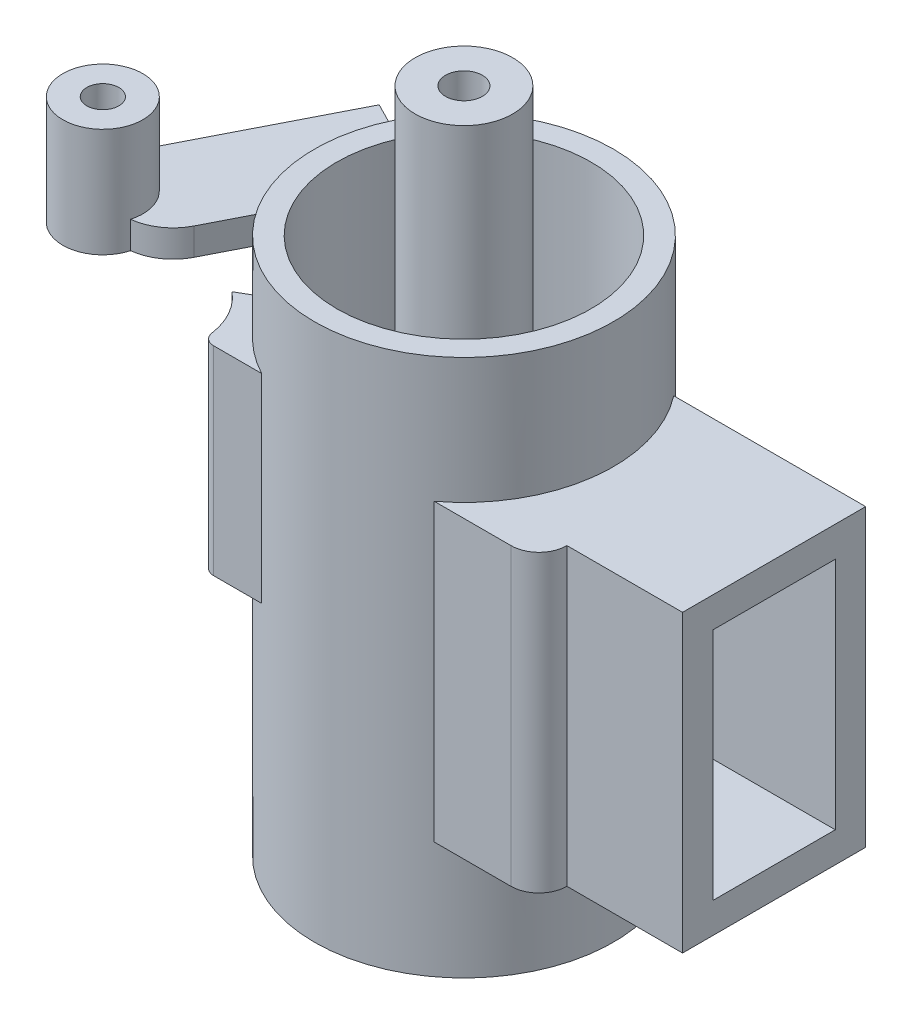
ISO-10303-21;
HEADER;
FILE_DESCRIPTION(('STEP AP214'),'2;1');
FILE_NAME('part.step','',(''),(''),'','','');
FILE_SCHEMA(('AUTOMOTIVE_DESIGN { 1 0 10303 214 1 1 1 1 }'));
ENDSEC;
DATA;
#1=APPLICATION_CONTEXT('core data for automotive mechanical design processes');
#2=APPLICATION_PROTOCOL_DEFINITION('international standard','automotive_design',2000,#1);
#3=PRODUCT_CONTEXT('',#1,'mechanical');
#4=PRODUCT('Part','Part','',(#3));
#5=PRODUCT_RELATED_PRODUCT_CATEGORY('part','',(#4));
#6=PRODUCT_DEFINITION_FORMATION('','',#4);
#7=PRODUCT_DEFINITION_CONTEXT('part definition',#1,'design');
#8=PRODUCT_DEFINITION('design','',#6,#7);
#9=PRODUCT_DEFINITION_SHAPE('','',#8);
#10=(LENGTH_UNIT() NAMED_UNIT(*) SI_UNIT(.MILLI.,.METRE.));
#11=(NAMED_UNIT(*) PLANE_ANGLE_UNIT() SI_UNIT($,.RADIAN.));
#12=(NAMED_UNIT(*) SI_UNIT($,.STERADIAN.) SOLID_ANGLE_UNIT());
#13=UNCERTAINTY_MEASURE_WITH_UNIT(LENGTH_MEASURE(1.E-05),#10,'distance_accuracy_value','');
#14=(GEOMETRIC_REPRESENTATION_CONTEXT(3) GLOBAL_UNCERTAINTY_ASSIGNED_CONTEXT((#13)) GLOBAL_UNIT_ASSIGNED_CONTEXT((#10,
#11,#12)) REPRESENTATION_CONTEXT('',''));
#15=CARTESIAN_POINT('',(0.,0.,0.));
#16=DIRECTION('',(0.,0.,1.));
#17=DIRECTION('',(1.,0.,0.));
#18=AXIS2_PLACEMENT_3D('',#15,#16,#17);
#19=CARTESIAN_POINT('',(0.,31.6,0.));
#20=DIRECTION('',(0.,-1.,0.));
#21=DIRECTION('',(0.,0.,-1.));
#22=AXIS2_PLACEMENT_3D('',#19,#20,#21);
#23=CYLINDRICAL_SURFACE('',#22,9.35);
#24=CARTESIAN_POINT('',(0.,33.6,0.));
#25=DIRECTION('',(0.,1.,0.));
#26=DIRECTION('',(0.,0.,1.));
#27=AXIS2_PLACEMENT_3D('',#24,#25,#26);
#28=CIRCLE('',#27,9.35);
#29=CARTESIAN_POINT('',(0.,33.6,9.35));
#30=VERTEX_POINT('',#29);
#31=EDGE_CURVE('E283',#30,#30,#28,.T.);
#32=ORIENTED_EDGE('',*,*,#31,.F.);
#33=EDGE_LOOP('',(#32));
#34=FACE_BOUND('',#33,.T.);
#35=DIRECTION('',(0.,-1.,0.));
#36=VECTOR('',#35,1.);
#37=CARTESIAN_POINT('',(-4.39999999999999,28.05,8.25));
#38=LINE('',#37,#36);
#39=CARTESIAN_POINT('',(-4.4,28.05,8.25));
#40=VERTEX_POINT('',#39);
#41=CARTESIAN_POINT('',(-4.39999999999999,15.6,8.25));
#42=VERTEX_POINT('',#41);
#43=EDGE_CURVE('E313',#40,#42,#38,.T.);
#44=ORIENTED_EDGE('',*,*,#43,.T.);
#45=CARTESIAN_POINT('',(0.,15.6,0.));
#46=DIRECTION('',(0.,1.,0.));
#47=DIRECTION('',(0.,0.,-1.));
#48=AXIS2_PLACEMENT_3D('',#45,#46,#47);
#49=CIRCLE('',#48,9.35);
#50=CARTESIAN_POINT('',(-8.45118334909378,15.6,4.));
#51=VERTEX_POINT('',#50);
#52=EDGE_CURVE('E286',#51,#42,#49,.T.);
#53=ORIENTED_EDGE('',*,*,#52,.F.);
#54=DIRECTION('',(0.,-1.,0.));
#55=VECTOR('',#54,1.);
#56=CARTESIAN_POINT('',(-8.45118334909378,28.05,4.));
#57=LINE('',#56,#55);
#58=CARTESIAN_POINT('',(-8.45118334909378,28.05,4.));
#59=VERTEX_POINT('',#58);
#60=EDGE_CURVE('E78',#59,#51,#57,.T.);
#61=ORIENTED_EDGE('',*,*,#60,.F.);
#62=CARTESIAN_POINT('',(0.,28.05,0.));
#63=DIRECTION('',(0.,-1.,0.));
#64=DIRECTION('',(0.,0.,1.));
#65=AXIS2_PLACEMENT_3D('',#62,#63,#64);
#66=CIRCLE('',#65,9.35);
#67=EDGE_CURVE('E301',#40,#59,#66,.T.);
#68=ORIENTED_EDGE('',*,*,#67,.F.);
#69=EDGE_LOOP('',(#44,#53,#61,#68));
#70=FACE_BOUND('',#69,.T.);
#71=DIRECTION('',(0.,-1.,0.));
#72=VECTOR('',#71,1.);
#73=CARTESIAN_POINT('',(5.61666048466524,25.75,7.475));
#74=LINE('',#73,#72);
#75=CARTESIAN_POINT('',(5.61666048466525,25.75,7.475));
#76=VERTEX_POINT('',#75);
#77=CARTESIAN_POINT('',(5.61666048466524,7.3,7.475));
#78=VERTEX_POINT('',#77);
#79=EDGE_CURVE('E428',#76,#78,#74,.T.);
#80=ORIENTED_EDGE('',*,*,#79,.F.);
#81=CARTESIAN_POINT('',(0.,25.75,0.));
#82=DIRECTION('',(0.,1.,0.));
#83=DIRECTION('',(0.,0.,1.));
#84=AXIS2_PLACEMENT_3D('',#81,#82,#83);
#85=CIRCLE('',#84,9.35);
#86=CARTESIAN_POINT('',(7.39235246724613,25.75,-5.725));
#87=VERTEX_POINT('',#86);
#88=EDGE_CURVE('E385',#76,#87,#85,.T.);
#89=ORIENTED_EDGE('',*,*,#88,.T.);
#90=DIRECTION('',(0.,-1.,0.));
#91=VECTOR('',#90,1.);
#92=CARTESIAN_POINT('',(7.39235246724613,25.75,-5.725));
#93=LINE('',#92,#91);
#94=CARTESIAN_POINT('',(7.39235246724613,7.3,-5.725));
#95=VERTEX_POINT('',#94);
#96=EDGE_CURVE('E402',#87,#95,#93,.T.);
#97=ORIENTED_EDGE('',*,*,#96,.T.);
#98=CARTESIAN_POINT('',(0.,7.3,0.));
#99=DIRECTION('',(0.,1.,0.));
#100=DIRECTION('',(0.,0.,1.));
#101=AXIS2_PLACEMENT_3D('',#98,#99,#100);
#102=CIRCLE('',#101,9.35);
#103=EDGE_CURVE('E384',#78,#95,#102,.T.);
#104=ORIENTED_EDGE('',*,*,#103,.F.);
#105=EDGE_LOOP('',(#80,#89,#97,#104));
#106=FACE_BOUND('',#105,.T.);
#107=CARTESIAN_POINT('',(0.,0.,0.));
#108=DIRECTION('',(0.,1.,0.));
#109=DIRECTION('',(0.,0.,1.));
#110=AXIS2_PLACEMENT_3D('',#107,#108,#109);
#111=CIRCLE('',#110,9.35);
#112=CARTESIAN_POINT('',(0.,0.,9.35));
#113=VERTEX_POINT('',#112);
#114=EDGE_CURVE('E434',#113,#113,#111,.T.);
#115=ORIENTED_EDGE('',*,*,#114,.T.);
#116=EDGE_LOOP('',(#115));
#117=FACE_BOUND('',#116,.T.);
#118=CARTESIAN_POINT('',(0.,32.5,0.));
#119=DIRECTION('',(0.,-1.,0.));
#120=DIRECTION('',(0.,0.,1.));
#121=AXIS2_PLACEMENT_3D('',#118,#119,#120);
#122=CIRCLE('',#121,9.35);
#123=CARTESIAN_POINT('',(-8.52611136715884,32.5,3.83769787174613));
#124=VERTEX_POINT('',#123);
#125=CARTESIAN_POINT('',(-8.3282651254628,32.5,-4.25));
#126=VERTEX_POINT('',#125);
#127=EDGE_CURVE('E249',#124,#126,#122,.T.);
#128=ORIENTED_EDGE('',*,*,#127,.F.);
#129=DIRECTION('',(0.,1.,0.));
#130=VECTOR('',#129,1.);
#131=CARTESIAN_POINT('',(-8.52611136715884,29.9,3.83769787174613));
#132=LINE('',#131,#130);
#133=CARTESIAN_POINT('',(-8.52611136715884,30.8,3.83769787174613));
#134=VERTEX_POINT('',#133);
#135=EDGE_CURVE('E12',#134,#124,#132,.T.);
#136=ORIENTED_EDGE('',*,*,#135,.F.);
#137=CARTESIAN_POINT('',(0.,30.8,0.));
#138=DIRECTION('',(0.,1.,0.));
#139=DIRECTION('',(0.,0.,-1.));
#140=AXIS2_PLACEMENT_3D('',#137,#138,#139);
#141=CIRCLE('',#140,9.35);
#142=CARTESIAN_POINT('',(-8.3282651254628,30.8,-4.25));
#143=VERTEX_POINT('',#142);
#144=EDGE_CURVE('E276',#143,#134,#141,.T.);
#145=ORIENTED_EDGE('',*,*,#144,.F.);
#146=DIRECTION('',(0.,1.,0.));
#147=VECTOR('',#146,1.);
#148=CARTESIAN_POINT('',(-8.3282651254628,29.9,-4.25));
#149=LINE('',#148,#147);
#150=EDGE_CURVE('E59',#143,#126,#149,.T.);
#151=ORIENTED_EDGE('',*,*,#150,.T.);
#152=EDGE_LOOP('',(#128,#136,#145,#151));
#153=FACE_BOUND('',#152,.T.);
#154=ADVANCED_FACE('F55',(#34,#70,#106,#117,#153),#23,.T.);
#155=CARTESIAN_POINT('',(-10.0539859758351,29.9,6.83170841751514));
#156=DIRECTION('',(0.890723542830247,0.,0.454545454545455));
#157=DIRECTION('',(0.454545454545455,0.,-0.890723542830247));
#158=AXIS2_PLACEMENT_3D('',#155,#156,#157);
#159=PLANE('',#158);
#160=DIRECTION('',(0.,1.,0.));
#161=VECTOR('',#160,1.);
#162=CARTESIAN_POINT('',(-10.0539859758351,29.9,6.83170841751514));
#163=LINE('',#162,#161);
#164=CARTESIAN_POINT('',(-10.0539859758351,30.8,6.83170841751514));
#165=VERTEX_POINT('',#164);
#166=CARTESIAN_POINT('',(-10.0539859758351,32.5,6.83170841751514));
#167=VERTEX_POINT('',#166);
#168=EDGE_CURVE('E64',#165,#167,#163,.T.);
#169=ORIENTED_EDGE('',*,*,#168,.F.);
#170=DIRECTION('',(-0.454545454545455,0.,0.890723542830246));
#171=VECTOR('',#170,1.);
#172=CARTESIAN_POINT('',(-8.52611136715884,30.8,3.83769787174613));
#173=LINE('',#172,#171);
#174=EDGE_CURVE('E278',#134,#165,#173,.T.);
#175=ORIENTED_EDGE('',*,*,#174,.F.);
#176=ORIENTED_EDGE('',*,*,#135,.T.);
#177=DIRECTION('',(0.454545454545455,0.,-0.890723542830247));
#178=VECTOR('',#177,1.);
#179=CARTESIAN_POINT('',(-10.0539859758351,32.5,6.83170841751514));
#180=LINE('',#179,#178);
#181=EDGE_CURVE('E244',#167,#124,#180,.T.);
#182=ORIENTED_EDGE('',*,*,#181,.F.);
#183=EDGE_LOOP('',(#169,#175,#176,#182));
#184=FACE_BOUND('',#183,.T.);
#185=ADVANCED_FACE('F245',(#184),#159,.T.);
#186=CARTESIAN_POINT('',(-12.7261566043258,29.9,5.46807205387877));
#187=DIRECTION('',(0.,1.,0.));
#188=DIRECTION('',(0.,0.,1.));
#189=AXIS2_PLACEMENT_3D('',#186,#187,#188);
#190=CYLINDRICAL_SURFACE('',#189,3.);
#191=DIRECTION('',(0.,1.,0.));
#192=VECTOR('',#191,1.);
#193=CARTESIAN_POINT('',(-12.3946883574281,33.75,8.44970395626018));
#194=LINE('',#193,#192);
#195=CARTESIAN_POINT('',(-12.3946883574281,30.8,8.44970395626018));
#196=VERTEX_POINT('',#195);
#197=CARTESIAN_POINT('',(-12.3946883574281,32.5,8.44970395626018));
#198=VERTEX_POINT('',#197);
#199=EDGE_CURVE('E467',#196,#198,#194,.T.);
#200=ORIENTED_EDGE('',*,*,#199,.F.);
#201=CARTESIAN_POINT('',(-12.7261566043258,30.8,5.46807205387877));
#202=DIRECTION('',(0.,-1.,0.));
#203=DIRECTION('',(0.,0.,-1.));
#204=AXIS2_PLACEMENT_3D('',#201,#202,#203);
#205=CIRCLE('',#204,3.);
#206=EDGE_CURVE('E241',#165,#196,#205,.T.);
#207=ORIENTED_EDGE('',*,*,#206,.F.);
#208=ORIENTED_EDGE('',*,*,#168,.T.);
#209=CARTESIAN_POINT('',(-12.7261566043258,32.5,5.46807205387877));
#210=DIRECTION('',(0.,1.,0.));
#211=DIRECTION('',(0.,0.,1.));
#212=AXIS2_PLACEMENT_3D('',#209,#210,#211);
#213=CIRCLE('',#212,3.);
#214=EDGE_CURVE('E240',#198,#167,#213,.T.);
#215=ORIENTED_EDGE('',*,*,#214,.F.);
#216=EDGE_LOOP('',(#200,#207,#208,#215));
#217=FACE_BOUND('',#216,.T.);
#218=ADVANCED_FACE('F238',(#217),#190,.T.);
#219=CARTESIAN_POINT('',(-10.8222910453875,29.9,-5.52272727272727));
#220=DIRECTION('',(-0.890723542830247,0.,-0.454545454545454));
#221=DIRECTION('',(-0.454545454545454,0.,0.890723542830247));
#222=AXIS2_PLACEMENT_3D('',#219,#220,#221);
#223=PLANE('',#222);
#224=DIRECTION('',(0.,1.,0.));
#225=VECTOR('',#224,1.);
#226=CARTESIAN_POINT('',(-10.8222910453875,29.9,-5.52272727272727));
#227=LINE('',#226,#225);
#228=CARTESIAN_POINT('',(-10.8222910453875,30.8,-5.52272727272727));
#229=VERTEX_POINT('',#228);
#230=CARTESIAN_POINT('',(-10.8222910453875,32.5,-5.52272727272727));
#231=VERTEX_POINT('',#230);
#232=EDGE_CURVE('E469',#229,#231,#227,.T.);
#233=ORIENTED_EDGE('',*,*,#232,.F.);
#234=DIRECTION('',(0.454545454545454,0.,-0.890723542830247));
#235=VECTOR('',#234,1.);
#236=CARTESIAN_POINT('',(-17.029180659302,30.8,6.64024268236952));
#237=LINE('',#236,#235);
#238=CARTESIAN_POINT('',(-17.029180659302,30.8,6.64024268236952));
#239=VERTEX_POINT('',#238);
#240=EDGE_CURVE('E271',#239,#229,#237,.T.);
#241=ORIENTED_EDGE('',*,*,#240,.F.);
#242=DIRECTION('',(0.,1.,0.));
#243=VECTOR('',#242,1.);
#244=CARTESIAN_POINT('',(-17.029180659302,29.9,6.64024268236952));
#245=LINE('',#244,#243);
#246=CARTESIAN_POINT('',(-17.029180659302,32.5,6.64024268236952));
#247=VERTEX_POINT('',#246);
#248=EDGE_CURVE('E242',#239,#247,#245,.T.);
#249=ORIENTED_EDGE('',*,*,#248,.T.);
#250=DIRECTION('',(-0.454545454545454,0.,0.890723542830247));
#251=VECTOR('',#250,1.);
#252=CARTESIAN_POINT('',(-10.8222910453875,32.5,-5.52272727272727));
#253=LINE('',#252,#251);
#254=EDGE_CURVE('E262',#231,#247,#253,.T.);
#255=ORIENTED_EDGE('',*,*,#254,.F.);
#256=EDGE_LOOP('',(#233,#241,#249,#255));
#257=FACE_BOUND('',#256,.T.);
#258=ADVANCED_FACE('F479',(#257),#223,.T.);
#259=CARTESIAN_POINT('',(-8.3282651254628,29.9,-4.25));
#260=DIRECTION('',(0.454545454545455,0.,-0.890723542830246));
#261=DIRECTION('',(-0.890723542830246,0.,-0.454545454545455));
#262=AXIS2_PLACEMENT_3D('',#259,#260,#261);
#263=PLANE('',#262);
#264=ORIENTED_EDGE('',*,*,#150,.F.);
#265=DIRECTION('',(0.890723542830246,0.,0.454545454545455));
#266=VECTOR('',#265,1.);
#267=CARTESIAN_POINT('',(-10.8222910453875,30.8,-5.52272727272727));
#268=LINE('',#267,#266);
#269=EDGE_CURVE('E273',#229,#143,#268,.T.);
#270=ORIENTED_EDGE('',*,*,#269,.F.);
#271=ORIENTED_EDGE('',*,*,#232,.T.);
#272=DIRECTION('',(-0.890723542830246,0.,-0.454545454545455));
#273=VECTOR('',#272,1.);
#274=CARTESIAN_POINT('',(-8.3282651254628,32.5,-4.25));
#275=LINE('',#274,#273);
#276=EDGE_CURVE('E259',#126,#231,#275,.T.);
#277=ORIENTED_EDGE('',*,*,#276,.F.);
#278=EDGE_LOOP('',(#264,#270,#271,#277));
#279=FACE_BOUND('',#278,.T.);
#280=ADVANCED_FACE('F57',(#279),#263,.T.);
#281=CARTESIAN_POINT('',(-14.8023718022264,22.8289321881345,7.77660631873315));
#282=DIRECTION('',(0.,1.,0.));
#283=DIRECTION('',(0.,0.,1.));
#284=AXIS2_PLACEMENT_3D('',#281,#282,#283);
#285=CYLINDRICAL_SURFACE('',#284,2.5);
#286=CARTESIAN_POINT('',(-14.8023718022264,32.5,7.77660631873315));
#287=DIRECTION('',(0.,1.,0.));
#288=DIRECTION('',(0.,0.,1.));
#289=AXIS2_PLACEMENT_3D('',#286,#287,#288);
#290=CIRCLE('',#289,2.5);
#291=EDGE_CURVE('E255',#247,#198,#290,.F.);
#292=ORIENTED_EDGE('',*,*,#291,.F.);
#293=ORIENTED_EDGE('',*,*,#248,.F.);
#294=CARTESIAN_POINT('',(-14.8023718022264,30.8,7.77660631873315));
#295=DIRECTION('',(0.,-1.,0.));
#296=DIRECTION('',(0.,0.,-1.));
#297=AXIS2_PLACEMENT_3D('',#294,#295,#296);
#298=CIRCLE('',#297,2.5);
#299=EDGE_CURVE('E269',#196,#239,#298,.T.);
#300=ORIENTED_EDGE('',*,*,#299,.F.);
#301=ORIENTED_EDGE('',*,*,#199,.T.);
#302=EDGE_LOOP('',(#292,#293,#300,#301));
#303=FACE_BOUND('',#302,.T.);
#304=CARTESIAN_POINT('',(-14.8023718022264,37.6,7.77660631873315));
#305=DIRECTION('',(0.,1.,0.));
#306=DIRECTION('',(0.,0.,1.));
#307=AXIS2_PLACEMENT_3D('',#304,#305,#306);
#308=CIRCLE('',#307,2.5);
#309=CARTESIAN_POINT('',(-14.8023718022264,37.6,10.2766063187332));
#310=VERTEX_POINT('',#309);
#311=EDGE_CURVE('E464',#310,#310,#308,.T.);
#312=ORIENTED_EDGE('',*,*,#311,.F.);
#313=EDGE_LOOP('',(#312));
#314=FACE_BOUND('',#313,.T.);
#315=ADVANCED_FACE('F478',(#303,#314),#285,.T.);
#316=CARTESIAN_POINT('',(-14.8023718022264,22.8289321881345,7.77660631873315));
#317=DIRECTION('',(0.,1.,0.));
#318=DIRECTION('',(0.,0.,1.));
#319=AXIS2_PLACEMENT_3D('',#316,#317,#318);
#320=CYLINDRICAL_SURFACE('',#319,1.);
#321=CARTESIAN_POINT('',(-14.8023718022264,32.5,7.77660631873315));
#322=DIRECTION('',(0.,1.,0.));
#323=DIRECTION('',(0.,0.,1.));
#324=AXIS2_PLACEMENT_3D('',#321,#322,#323);
#325=CIRCLE('',#324,1.);
#326=CARTESIAN_POINT('',(-14.8023718022264,32.5,8.77660631873315));
#327=VERTEX_POINT('',#326);
#328=EDGE_CURVE('E264',#327,#327,#325,.F.);
#329=ORIENTED_EDGE('',*,*,#328,.T.);
#330=EDGE_LOOP('',(#329));
#331=FACE_BOUND('',#330,.T.);
#332=CARTESIAN_POINT('',(-14.8023718022264,37.6,7.77660631873315));
#333=DIRECTION('',(0.,1.,0.));
#334=DIRECTION('',(0.,0.,1.));
#335=AXIS2_PLACEMENT_3D('',#332,#333,#334);
#336=CIRCLE('',#335,1.);
#337=CARTESIAN_POINT('',(-14.8023718022264,37.6,8.77660631873315));
#338=VERTEX_POINT('',#337);
#339=EDGE_CURVE('E461',#338,#338,#336,.T.);
#340=ORIENTED_EDGE('',*,*,#339,.T.);
#341=EDGE_LOOP('',(#340));
#342=FACE_BOUND('',#341,.T.);
#343=ADVANCED_FACE('F484',(#331,#342),#320,.F.);
#344=CARTESIAN_POINT('',(-14.8023718022264,37.6,7.77660631873315));
#345=DIRECTION('',(0.,1.,0.));
#346=DIRECTION('',(0.,0.,1.));
#347=AXIS2_PLACEMENT_3D('',#344,#345,#346);
#348=PLANE('',#347);
#349=ORIENTED_EDGE('',*,*,#311,.T.);
#350=EDGE_LOOP('',(#349));
#351=FACE_BOUND('',#350,.T.);
#352=ORIENTED_EDGE('',*,*,#339,.F.);
#353=EDGE_LOOP('',(#352));
#354=FACE_BOUND('',#353,.T.);
#355=ADVANCED_FACE('F505',(#351,#354),#348,.T.);
#356=CARTESIAN_POINT('',(0.,16.2,0.));
#357=DIRECTION('',(0.,1.,0.));
#358=DIRECTION('',(0.,0.,1.));
#359=AXIS2_PLACEMENT_3D('',#356,#357,#358);
#360=PLANE('',#359);
#361=DIRECTION('',(0.,0.,1.));
#362=VECTOR('',#361,1.);
#363=CARTESIAN_POINT('',(1.06935255242551,16.2,-3.825));
#364=LINE('',#363,#362);
#365=CARTESIAN_POINT('',(1.06935255242551,16.2,-3.825));
#366=VERTEX_POINT('',#365);
#367=CARTESIAN_POINT('',(1.06935255242551,16.2,-2.85639372612059));
#368=VERTEX_POINT('',#367);
#369=EDGE_CURVE('E342',#366,#368,#364,.T.);
#370=ORIENTED_EDGE('',*,*,#369,.F.);
#371=DIRECTION('',(-1.,0.,0.));
#372=VECTOR('',#371,1.);
#373=CARTESIAN_POINT('',(6.96935255242551,16.2,-3.825));
#374=LINE('',#373,#372);
#375=CARTESIAN_POINT('',(6.96935255242551,16.2,-3.825));
#376=VERTEX_POINT('',#375);
#377=EDGE_CURVE('E345',#376,#366,#374,.T.);
#378=ORIENTED_EDGE('',*,*,#377,.F.);
#379=CARTESIAN_POINT('',(0.,16.2,0.));
#380=DIRECTION('',(0.,1.,0.));
#381=DIRECTION('',(0.,0.,1.));
#382=AXIS2_PLACEMENT_3D('',#379,#380,#381);
#383=CIRCLE('',#382,7.95);
#384=CARTESIAN_POINT('',(6.96935255242551,16.2,3.825));
#385=VERTEX_POINT('',#384);
#386=EDGE_CURVE('E441',#376,#385,#383,.T.);
#387=ORIENTED_EDGE('',*,*,#386,.T.);
#388=DIRECTION('',(1.,0.,0.));
#389=VECTOR('',#388,1.);
#390=CARTESIAN_POINT('',(6.96935255242551,16.2,3.825));
#391=LINE('',#390,#389);
#392=CARTESIAN_POINT('',(1.06935255242551,16.2,3.825));
#393=VERTEX_POINT('',#392);
#394=EDGE_CURVE('E325',#393,#385,#391,.T.);
#395=ORIENTED_EDGE('',*,*,#394,.F.);
#396=DIRECTION('',(0.,0.,1.));
#397=VECTOR('',#396,1.);
#398=CARTESIAN_POINT('',(1.06935255242551,16.2,3.825));
#399=LINE('',#398,#397);
#400=CARTESIAN_POINT('',(1.06935255242551,16.2,2.85639372612059));
#401=VERTEX_POINT('',#400);
#402=EDGE_CURVE('E338',#401,#393,#399,.T.);
#403=ORIENTED_EDGE('',*,*,#402,.F.);
#404=CARTESIAN_POINT('',(0.,16.2,0.));
#405=DIRECTION('',(0.,1.,0.));
#406=DIRECTION('',(0.,0.,1.));
#407=AXIS2_PLACEMENT_3D('',#404,#405,#406);
#408=CIRCLE('',#407,3.05);
#409=EDGE_CURVE('E437',#368,#401,#408,.T.);
#410=ORIENTED_EDGE('',*,*,#409,.F.);
#411=EDGE_LOOP('',(#370,#378,#387,#395,#403,#410));
#412=FACE_BOUND('',#411,.T.);
#413=ADVANCED_FACE('F501',(#412),#360,.T.);
#414=CARTESIAN_POINT('',(0.,16.,0.));
#415=DIRECTION('',(0.,1.,0.));
#416=DIRECTION('',(0.,0.,1.));
#417=AXIS2_PLACEMENT_3D('',#414,#415,#416);
#418=PLANE('',#417);
#419=DIRECTION('',(-1.,0.,0.));
#420=VECTOR('',#419,1.);
#421=CARTESIAN_POINT('',(6.96935255242551,16.,-3.825));
#422=LINE('',#421,#420);
#423=CARTESIAN_POINT('',(6.96935255242551,16.,-3.825));
#424=VERTEX_POINT('',#423);
#425=CARTESIAN_POINT('',(1.06935255242551,16.,-3.825));
#426=VERTEX_POINT('',#425);
#427=EDGE_CURVE('E322',#424,#426,#422,.T.);
#428=ORIENTED_EDGE('',*,*,#427,.T.);
#429=DIRECTION('',(0.,0.,1.));
#430=VECTOR('',#429,1.);
#431=CARTESIAN_POINT('',(1.06935255242551,16.,-3.825));
#432=LINE('',#431,#430);
#433=CARTESIAN_POINT('',(1.06935255242551,16.,-2.85639372612059));
#434=VERTEX_POINT('',#433);
#435=EDGE_CURVE('E331',#426,#434,#432,.T.);
#436=ORIENTED_EDGE('',*,*,#435,.T.);
#437=CARTESIAN_POINT('',(0.,16.,0.));
#438=DIRECTION('',(0.,1.,0.));
#439=DIRECTION('',(0.,0.,1.));
#440=AXIS2_PLACEMENT_3D('',#437,#438,#439);
#441=CIRCLE('',#440,3.05);
#442=CARTESIAN_POINT('',(1.06935255242551,16.,2.85639372612059));
#443=VERTEX_POINT('',#442);
#444=EDGE_CURVE('E456',#434,#443,#441,.T.);
#445=ORIENTED_EDGE('',*,*,#444,.T.);
#446=DIRECTION('',(0.,0.,1.));
#447=VECTOR('',#446,1.);
#448=CARTESIAN_POINT('',(1.06935255242551,16.,3.825));
#449=LINE('',#448,#447);
#450=CARTESIAN_POINT('',(1.06935255242551,16.,3.825));
#451=VERTEX_POINT('',#450);
#452=EDGE_CURVE('E327',#443,#451,#449,.T.);
#453=ORIENTED_EDGE('',*,*,#452,.T.);
#454=DIRECTION('',(1.,0.,0.));
#455=VECTOR('',#454,1.);
#456=CARTESIAN_POINT('',(6.96935255242551,16.,3.825));
#457=LINE('',#456,#455);
#458=CARTESIAN_POINT('',(6.96935255242551,16.,3.825));
#459=VERTEX_POINT('',#458);
#460=EDGE_CURVE('E323',#451,#459,#457,.T.);
#461=ORIENTED_EDGE('',*,*,#460,.T.);
#462=CARTESIAN_POINT('',(0.,16.,0.));
#463=DIRECTION('',(0.,1.,0.));
#464=DIRECTION('',(0.,0.,1.));
#465=AXIS2_PLACEMENT_3D('',#462,#463,#464);
#466=CIRCLE('',#465,7.95);
#467=EDGE_CURVE('E440',#424,#459,#466,.T.);
#468=ORIENTED_EDGE('',*,*,#467,.F.);
#469=EDGE_LOOP('',(#428,#436,#445,#453,#461,#468));
#470=FACE_BOUND('',#469,.T.);
#471=ADVANCED_FACE('F504',(#470),#418,.F.);
#472=CARTESIAN_POINT('',(0.,41.7,0.));
#473=DIRECTION('',(0.,1.,0.));
#474=DIRECTION('',(0.,0.,1.));
#475=AXIS2_PLACEMENT_3D('',#472,#473,#474);
#476=PLANE('',#475);
#477=CARTESIAN_POINT('',(0.,41.7,0.));
#478=DIRECTION('',(0.,1.,0.));
#479=DIRECTION('',(0.,0.,1.));
#480=AXIS2_PLACEMENT_3D('',#477,#478,#479);
#481=CIRCLE('',#480,3.05);
#482=CARTESIAN_POINT('',(0.,41.7,3.05));
#483=VERTEX_POINT('',#482);
#484=EDGE_CURVE('E453',#483,#483,#481,.T.);
#485=ORIENTED_EDGE('',*,*,#484,.T.);
#486=EDGE_LOOP('',(#485));
#487=FACE_BOUND('',#486,.T.);
#488=CARTESIAN_POINT('',(0.,41.7,0.));
#489=DIRECTION('',(0.,1.,0.));
#490=DIRECTION('',(0.,0.,1.));
#491=AXIS2_PLACEMENT_3D('',#488,#489,#490);
#492=CIRCLE('',#491,1.15);
#493=CARTESIAN_POINT('',(0.,41.7,1.15));
#494=VERTEX_POINT('',#493);
#495=EDGE_CURVE('E447',#494,#494,#492,.T.);
#496=ORIENTED_EDGE('',*,*,#495,.F.);
#497=EDGE_LOOP('',(#496));
#498=FACE_BOUND('',#497,.T.);
#499=ADVANCED_FACE('F509',(#487,#498),#476,.T.);
#500=CARTESIAN_POINT('',(0.,-3.3,0.));
#501=DIRECTION('',(0.,1.,0.));
#502=DIRECTION('',(0.,0.,1.));
#503=AXIS2_PLACEMENT_3D('',#500,#501,#502);
#504=PLANE('',#503);
#505=CARTESIAN_POINT('',(0.,-3.3,0.));
#506=DIRECTION('',(0.,1.,0.));
#507=DIRECTION('',(0.,0.,1.));
#508=AXIS2_PLACEMENT_3D('',#505,#506,#507);
#509=CIRCLE('',#508,3.05);
#510=CARTESIAN_POINT('',(0.,-3.3,3.05));
#511=VERTEX_POINT('',#510);
#512=EDGE_CURVE('E450',#511,#511,#509,.T.);
#513=ORIENTED_EDGE('',*,*,#512,.F.);
#514=EDGE_LOOP('',(#513));
#515=FACE_BOUND('',#514,.T.);
#516=CARTESIAN_POINT('',(0.,-3.3,0.));
#517=DIRECTION('',(0.,1.,0.));
#518=DIRECTION('',(0.,0.,1.));
#519=AXIS2_PLACEMENT_3D('',#516,#517,#518);
#520=CIRCLE('',#519,1.15);
#521=CARTESIAN_POINT('',(0.,-3.3,1.15));
#522=VERTEX_POINT('',#521);
#523=EDGE_CURVE('E444',#522,#522,#520,.T.);
#524=ORIENTED_EDGE('',*,*,#523,.T.);
#525=EDGE_LOOP('',(#524));
#526=FACE_BOUND('',#525,.T.);
#527=ADVANCED_FACE('F519',(#515,#526),#504,.F.);
#528=CARTESIAN_POINT('',(0.,41.7,0.));
#529=DIRECTION('',(0.,-1.,0.));
#530=DIRECTION('',(0.,0.,-1.));
#531=AXIS2_PLACEMENT_3D('',#528,#529,#530);
#532=CYLINDRICAL_SURFACE('',#531,3.05);
#533=ORIENTED_EDGE('',*,*,#409,.T.);
#534=DIRECTION('',(0.,-1.,0.));
#535=VECTOR('',#534,1.);
#536=CARTESIAN_POINT('',(1.06935255242551,26.4891112005757,2.85639372612059));
#537=LINE('',#536,#535);
#538=EDGE_CURVE('E330',#401,#443,#537,.T.);
#539=ORIENTED_EDGE('',*,*,#538,.T.);
#540=ORIENTED_EDGE('',*,*,#444,.F.);
#541=DIRECTION('',(0.,-1.,0.));
#542=VECTOR('',#541,1.);
#543=CARTESIAN_POINT('',(1.06935255242551,26.4891112005757,-2.85639372612059));
#544=LINE('',#543,#542);
#545=EDGE_CURVE('E334',#368,#434,#544,.T.);
#546=ORIENTED_EDGE('',*,*,#545,.F.);
#547=EDGE_LOOP('',(#533,#539,#540,#546));
#548=FACE_BOUND('',#547,.T.);
#549=ORIENTED_EDGE('',*,*,#484,.F.);
#550=EDGE_LOOP('',(#549));
#551=FACE_BOUND('',#550,.T.);
#552=ORIENTED_EDGE('',*,*,#512,.T.);
#553=EDGE_LOOP('',(#552));
#554=FACE_BOUND('',#553,.T.);
#555=ADVANCED_FACE('F515',(#548,#551,#554),#532,.T.);
#556=CARTESIAN_POINT('',(0.,41.7,0.));
#557=DIRECTION('',(0.,-1.,0.));
#558=DIRECTION('',(0.,0.,-1.));
#559=AXIS2_PLACEMENT_3D('',#556,#557,#558);
#560=CYLINDRICAL_SURFACE('',#559,1.15);
#561=ORIENTED_EDGE('',*,*,#495,.T.);
#562=EDGE_LOOP('',(#561));
#563=FACE_BOUND('',#562,.T.);
#564=ORIENTED_EDGE('',*,*,#523,.F.);
#565=EDGE_LOOP('',(#564));
#566=FACE_BOUND('',#565,.T.);
#567=ADVANCED_FACE('F511',(#563,#566),#560,.F.);
#568=CARTESIAN_POINT('',(0.,31.6,0.));
#569=DIRECTION('',(0.,-1.,0.));
#570=DIRECTION('',(0.,0.,-1.));
#571=AXIS2_PLACEMENT_3D('',#568,#569,#570);
#572=CYLINDRICAL_SURFACE('',#571,7.95);
#573=CARTESIAN_POINT('',(0.,0.,0.));
#574=DIRECTION('',(0.,1.,0.));
#575=DIRECTION('',(0.,0.,1.));
#576=AXIS2_PLACEMENT_3D('',#573,#574,#575);
#577=CIRCLE('',#576,7.95);
#578=CARTESIAN_POINT('',(0.,0.,7.95));
#579=VERTEX_POINT('',#578);
#580=EDGE_CURVE('E431',#579,#579,#577,.T.);
#581=ORIENTED_EDGE('',*,*,#580,.F.);
#582=EDGE_LOOP('',(#581));
#583=FACE_BOUND('',#582,.T.);
#584=ORIENTED_EDGE('',*,*,#467,.T.);
#585=DIRECTION('',(0.,-1.,0.));
#586=VECTOR('',#585,1.);
#587=CARTESIAN_POINT('',(6.96935255242551,31.6,3.825));
#588=LINE('',#587,#586);
#589=CARTESIAN_POINT('',(6.96935255242551,9.2,3.825));
#590=VERTEX_POINT('',#589);
#591=EDGE_CURVE('E375',#590,#459,#588,.F.);
#592=ORIENTED_EDGE('',*,*,#591,.F.);
#593=CARTESIAN_POINT('',(0.,9.2,0.));
#594=DIRECTION('',(0.,-1.,0.));
#595=DIRECTION('',(0.,0.,-1.));
#596=AXIS2_PLACEMENT_3D('',#593,#594,#595);
#597=CIRCLE('',#596,7.95);
#598=CARTESIAN_POINT('',(6.96935255242551,9.2,-3.825));
#599=VERTEX_POINT('',#598);
#600=EDGE_CURVE('E378',#599,#590,#597,.T.);
#601=ORIENTED_EDGE('',*,*,#600,.F.);
#602=DIRECTION('',(0.,-1.,0.));
#603=VECTOR('',#602,1.);
#604=CARTESIAN_POINT('',(6.96935255242551,31.6,-3.825));
#605=LINE('',#604,#603);
#606=EDGE_CURVE('E380',#424,#599,#605,.T.);
#607=ORIENTED_EDGE('',*,*,#606,.F.);
#608=EDGE_LOOP('',(#584,#592,#601,#607));
#609=FACE_BOUND('',#608,.T.);
#610=ADVANCED_FACE('F514',(#583,#609),#572,.F.);
#611=CARTESIAN_POINT('',(0.,0.,0.));
#612=DIRECTION('',(0.,1.,0.));
#613=DIRECTION('',(0.,0.,1.));
#614=AXIS2_PLACEMENT_3D('',#611,#612,#613);
#615=PLANE('',#614);
#616=ORIENTED_EDGE('',*,*,#114,.F.);
#617=EDGE_LOOP('',(#616));
#618=FACE_BOUND('',#617,.T.);
#619=ORIENTED_EDGE('',*,*,#580,.T.);
#620=EDGE_LOOP('',(#619));
#621=FACE_BOUND('',#620,.T.);
#622=ADVANCED_FACE('F499',(#618,#621),#615,.F.);
#623=CARTESIAN_POINT('',(6.96935255242551,23.85,3.825));
#624=VERTEX_POINT('',#623);
#625=EDGE_CURVE('E374',#385,#624,#588,.F.);
#626=ORIENTED_EDGE('',*,*,#625,.F.);
#627=ORIENTED_EDGE('',*,*,#386,.F.);
#628=CARTESIAN_POINT('',(6.96935255242551,23.85,-3.825));
#629=VERTEX_POINT('',#628);
#630=EDGE_CURVE('E381',#629,#376,#605,.T.);
#631=ORIENTED_EDGE('',*,*,#630,.F.);
#632=CARTESIAN_POINT('',(0.,23.85,0.));
#633=DIRECTION('',(0.,1.,0.));
#634=DIRECTION('',(0.,0.,1.));
#635=AXIS2_PLACEMENT_3D('',#632,#633,#634);
#636=CIRCLE('',#635,7.95);
#637=EDGE_CURVE('E366',#624,#629,#636,.T.);
#638=ORIENTED_EDGE('',*,*,#637,.F.);
#639=EDGE_LOOP('',(#626,#627,#631,#638));
#640=FACE_BOUND('',#639,.T.);
#641=CARTESIAN_POINT('',(0.,33.6,0.));
#642=DIRECTION('',(0.,1.,0.));
#643=DIRECTION('',(0.,0.,1.));
#644=AXIS2_PLACEMENT_3D('',#641,#642,#643);
#645=CIRCLE('',#644,7.95);
#646=CARTESIAN_POINT('',(0.,33.6,7.95));
#647=VERTEX_POINT('',#646);
#648=EDGE_CURVE('E280',#647,#647,#645,.T.);
#649=ORIENTED_EDGE('',*,*,#648,.T.);
#650=EDGE_LOOP('',(#649));
#651=FACE_BOUND('',#650,.T.);
#652=ADVANCED_FACE('F654',(#640,#651),#572,.F.);
#653=CARTESIAN_POINT('',(0.,25.75,7.475));
#654=DIRECTION('',(0.,0.,1.));
#655=DIRECTION('',(1.,0.,0.));
#656=AXIS2_PLACEMENT_3D('',#653,#654,#655);
#657=PLANE('',#656);
#658=DIRECTION('',(-1.,0.,0.));
#659=VECTOR('',#658,1.);
#660=CARTESIAN_POINT('',(0.,7.3,7.475));
#661=LINE('',#660,#659);
#662=CARTESIAN_POINT('',(10.4166604846652,7.3,7.475));
#663=VERTEX_POINT('',#662);
#664=EDGE_CURVE('E405',#663,#78,#661,.T.);
#665=ORIENTED_EDGE('',*,*,#664,.F.);
#666=DIRECTION('',(0.,-1.,0.));
#667=VECTOR('',#666,1.);
#668=CARTESIAN_POINT('',(10.4166604846652,25.75,7.475));
#669=LINE('',#668,#667);
#670=CARTESIAN_POINT('',(10.4166604846652,25.75,7.475));
#671=VERTEX_POINT('',#670);
#672=EDGE_CURVE('E426',#671,#663,#669,.T.);
#673=ORIENTED_EDGE('',*,*,#672,.F.);
#674=DIRECTION('',(-1.,0.,0.));
#675=VECTOR('',#674,1.);
#676=CARTESIAN_POINT('',(0.,25.75,7.475));
#677=LINE('',#676,#675);
#678=EDGE_CURVE('E387',#671,#76,#677,.T.);
#679=ORIENTED_EDGE('',*,*,#678,.T.);
#680=ORIENTED_EDGE('',*,*,#79,.T.);
#681=EDGE_LOOP('',(#665,#673,#679,#680));
#682=FACE_BOUND('',#681,.T.);
#683=ADVANCED_FACE('F651',(#682),#657,.T.);
#684=CARTESIAN_POINT('',(10.4166604846652,25.75,5.725));
#685=DIRECTION('',(0.,-1.,0.));
#686=DIRECTION('',(0.,0.,-1.));
#687=AXIS2_PLACEMENT_3D('',#684,#685,#686);
#688=CYLINDRICAL_SURFACE('',#687,1.75);
#689=CARTESIAN_POINT('',(10.4166604846652,7.3,5.725));
#690=DIRECTION('',(0.,1.,0.));
#691=DIRECTION('',(0.,0.,1.));
#692=AXIS2_PLACEMENT_3D('',#689,#690,#691);
#693=CIRCLE('',#692,1.75);
#694=CARTESIAN_POINT('',(12.1666604846652,7.3,5.725));
#695=VERTEX_POINT('',#694);
#696=EDGE_CURVE('E408',#663,#695,#693,.T.);
#697=ORIENTED_EDGE('',*,*,#696,.T.);
#698=DIRECTION('',(0.,-1.,0.));
#699=VECTOR('',#698,1.);
#700=CARTESIAN_POINT('',(12.1666604846652,25.75,5.725));
#701=LINE('',#700,#699);
#702=CARTESIAN_POINT('',(12.1666604846652,25.75,5.725));
#703=VERTEX_POINT('',#702);
#704=EDGE_CURVE('E424',#703,#695,#701,.T.);
#705=ORIENTED_EDGE('',*,*,#704,.F.);
#706=CARTESIAN_POINT('',(10.4166604846652,25.75,5.725));
#707=DIRECTION('',(0.,1.,0.));
#708=DIRECTION('',(0.,0.,1.));
#709=AXIS2_PLACEMENT_3D('',#706,#707,#708);
#710=CIRCLE('',#709,1.75);
#711=EDGE_CURVE('E391',#671,#703,#710,.T.);
#712=ORIENTED_EDGE('',*,*,#711,.F.);
#713=ORIENTED_EDGE('',*,*,#672,.T.);
#714=EDGE_LOOP('',(#697,#705,#712,#713));
#715=FACE_BOUND('',#714,.T.);
#716=ADVANCED_FACE('F647',(#715),#688,.T.);
#717=CARTESIAN_POINT('',(0.,25.75,5.725));
#718=DIRECTION('',(0.,0.,1.));
#719=DIRECTION('',(1.,0.,0.));
#720=AXIS2_PLACEMENT_3D('',#717,#718,#719);
#721=PLANE('',#720);
#722=DIRECTION('',(-1.,0.,0.));
#723=VECTOR('',#722,1.);
#724=CARTESIAN_POINT('',(0.,7.3,5.725));
#725=LINE('',#724,#723);
#726=CARTESIAN_POINT('',(19.3923524672461,7.3,5.725));
#727=VERTEX_POINT('',#726);
#728=EDGE_CURVE('E411',#727,#695,#725,.T.);
#729=ORIENTED_EDGE('',*,*,#728,.F.);
#730=DIRECTION('',(0.,-1.,0.));
#731=VECTOR('',#730,1.);
#732=CARTESIAN_POINT('',(19.3923524672461,25.75,5.725));
#733=LINE('',#732,#731);
#734=CARTESIAN_POINT('',(19.3923524672461,25.75,5.725));
#735=VERTEX_POINT('',#734);
#736=EDGE_CURVE('E422',#735,#727,#733,.T.);
#737=ORIENTED_EDGE('',*,*,#736,.F.);
#738=DIRECTION('',(-1.,0.,0.));
#739=VECTOR('',#738,1.);
#740=CARTESIAN_POINT('',(0.,25.75,5.725));
#741=LINE('',#740,#739);
#742=EDGE_CURVE('E393',#735,#703,#741,.T.);
#743=ORIENTED_EDGE('',*,*,#742,.T.);
#744=ORIENTED_EDGE('',*,*,#704,.T.);
#745=EDGE_LOOP('',(#729,#737,#743,#744));
#746=FACE_BOUND('',#745,.T.);
#747=ADVANCED_FACE('F643',(#746),#721,.T.);
#748=CARTESIAN_POINT('',(19.3923524672461,25.75,0.));
#749=DIRECTION('',(1.,0.,0.));
#750=DIRECTION('',(0.,0.,-1.));
#751=AXIS2_PLACEMENT_3D('',#748,#749,#750);
#752=PLANE('',#751);
#753=DIRECTION('',(0.,1.,0.));
#754=VECTOR('',#753,1.);
#755=CARTESIAN_POINT('',(19.3923524672461,9.2,-3.825));
#756=LINE('',#755,#754);
#757=CARTESIAN_POINT('',(19.3923524672461,9.2,-3.825));
#758=VERTEX_POINT('',#757);
#759=CARTESIAN_POINT('',(19.3923524672461,23.85,-3.825));
#760=VERTEX_POINT('',#759);
#761=EDGE_CURVE('E341',#758,#760,#756,.T.);
#762=ORIENTED_EDGE('',*,*,#761,.F.);
#763=DIRECTION('',(0.,0.,-1.));
#764=VECTOR('',#763,1.);
#765=CARTESIAN_POINT('',(19.3923524672461,9.2,3.825));
#766=LINE('',#765,#764);
#767=CARTESIAN_POINT('',(19.3923524672461,9.2,3.825));
#768=VERTEX_POINT('',#767);
#769=EDGE_CURVE('E360',#768,#758,#766,.T.);
#770=ORIENTED_EDGE('',*,*,#769,.F.);
#771=DIRECTION('',(0.,-1.,0.));
#772=VECTOR('',#771,1.);
#773=CARTESIAN_POINT('',(19.3923524672461,23.85,3.825));
#774=LINE('',#773,#772);
#775=CARTESIAN_POINT('',(19.3923524672461,23.85,3.825));
#776=VERTEX_POINT('',#775);
#777=EDGE_CURVE('E357',#776,#768,#774,.T.);
#778=ORIENTED_EDGE('',*,*,#777,.F.);
#779=DIRECTION('',(0.,0.,1.));
#780=VECTOR('',#779,1.);
#781=CARTESIAN_POINT('',(19.3923524672461,23.85,-3.825));
#782=LINE('',#781,#780);
#783=EDGE_CURVE('E354',#760,#776,#782,.T.);
#784=ORIENTED_EDGE('',*,*,#783,.F.);
#785=EDGE_LOOP('',(#762,#770,#778,#784));
#786=FACE_BOUND('',#785,.T.);
#787=DIRECTION('',(0.,0.,1.));
#788=VECTOR('',#787,1.);
#789=CARTESIAN_POINT('',(19.3923524672461,7.3,0.));
#790=LINE('',#789,#788);
#791=CARTESIAN_POINT('',(19.3923524672461,7.3,-5.725));
#792=VERTEX_POINT('',#791);
#793=EDGE_CURVE('E414',#792,#727,#790,.T.);
#794=ORIENTED_EDGE('',*,*,#793,.F.);
#795=DIRECTION('',(0.,-1.,0.));
#796=VECTOR('',#795,1.);
#797=CARTESIAN_POINT('',(19.3923524672461,25.75,-5.725));
#798=LINE('',#797,#796);
#799=CARTESIAN_POINT('',(19.3923524672461,25.75,-5.725));
#800=VERTEX_POINT('',#799);
#801=EDGE_CURVE('E420',#800,#792,#798,.T.);
#802=ORIENTED_EDGE('',*,*,#801,.F.);
#803=DIRECTION('',(0.,0.,1.));
#804=VECTOR('',#803,1.);
#805=CARTESIAN_POINT('',(19.3923524672461,25.75,0.));
#806=LINE('',#805,#804);
#807=EDGE_CURVE('E396',#800,#735,#806,.T.);
#808=ORIENTED_EDGE('',*,*,#807,.T.);
#809=ORIENTED_EDGE('',*,*,#736,.T.);
#810=EDGE_LOOP('',(#794,#802,#808,#809));
#811=FACE_BOUND('',#810,.T.);
#812=ADVANCED_FACE('F639',(#786,#811),#752,.T.);
#813=CARTESIAN_POINT('',(0.,25.75,-5.725));
#814=DIRECTION('',(0.,0.,-1.));
#815=DIRECTION('',(-1.,0.,0.));
#816=AXIS2_PLACEMENT_3D('',#813,#814,#815);
#817=PLANE('',#816);
#818=DIRECTION('',(1.,0.,0.));
#819=VECTOR('',#818,1.);
#820=CARTESIAN_POINT('',(0.,7.3,-5.725));
#821=LINE('',#820,#819);
#822=EDGE_CURVE('E388',#95,#792,#821,.T.);
#823=ORIENTED_EDGE('',*,*,#822,.F.);
#824=ORIENTED_EDGE('',*,*,#96,.F.);
#825=DIRECTION('',(1.,0.,0.));
#826=VECTOR('',#825,1.);
#827=CARTESIAN_POINT('',(0.,25.75,-5.725));
#828=LINE('',#827,#826);
#829=EDGE_CURVE('E399',#87,#800,#828,.T.);
#830=ORIENTED_EDGE('',*,*,#829,.T.);
#831=ORIENTED_EDGE('',*,*,#801,.T.);
#832=EDGE_LOOP('',(#823,#824,#830,#831));
#833=FACE_BOUND('',#832,.T.);
#834=ADVANCED_FACE('F632',(#833),#817,.T.);
#835=CARTESIAN_POINT('',(0.,25.75,0.));
#836=DIRECTION('',(0.,1.,0.));
#837=DIRECTION('',(0.,0.,1.));
#838=AXIS2_PLACEMENT_3D('',#835,#836,#837);
#839=PLANE('',#838);
#840=ORIENTED_EDGE('',*,*,#88,.F.);
#841=ORIENTED_EDGE('',*,*,#678,.F.);
#842=ORIENTED_EDGE('',*,*,#711,.T.);
#843=ORIENTED_EDGE('',*,*,#742,.F.);
#844=ORIENTED_EDGE('',*,*,#807,.F.);
#845=ORIENTED_EDGE('',*,*,#829,.F.);
#846=EDGE_LOOP('',(#840,#841,#842,#843,#844,#845));
#847=FACE_BOUND('',#846,.T.);
#848=ADVANCED_FACE('F629',(#847),#839,.T.);
#849=CARTESIAN_POINT('',(0.,7.3,0.));
#850=DIRECTION('',(0.,1.,0.));
#851=DIRECTION('',(0.,0.,1.));
#852=AXIS2_PLACEMENT_3D('',#849,#850,#851);
#853=PLANE('',#852);
#854=ORIENTED_EDGE('',*,*,#103,.T.);
#855=ORIENTED_EDGE('',*,*,#822,.T.);
#856=ORIENTED_EDGE('',*,*,#793,.T.);
#857=ORIENTED_EDGE('',*,*,#728,.T.);
#858=ORIENTED_EDGE('',*,*,#696,.F.);
#859=ORIENTED_EDGE('',*,*,#664,.T.);
#860=EDGE_LOOP('',(#854,#855,#856,#857,#858,#859));
#861=FACE_BOUND('',#860,.T.);
#862=ADVANCED_FACE('F627',(#861),#853,.F.);
#863=CARTESIAN_POINT('',(4.39235246724613,9.2,-3.825));
#864=DIRECTION('',(0.,0.,-1.));
#865=DIRECTION('',(-1.,0.,0.));
#866=AXIS2_PLACEMENT_3D('',#863,#864,#865);
#867=PLANE('',#866);
#868=ORIENTED_EDGE('',*,*,#630,.T.);
#869=ORIENTED_EDGE('',*,*,#377,.T.);
#870=DIRECTION('',(0.,-1.,0.));
#871=VECTOR('',#870,1.);
#872=CARTESIAN_POINT('',(1.06935255242551,26.4891112005757,-3.825));
#873=LINE('',#872,#871);
#874=EDGE_CURVE('E335',#366,#426,#873,.T.);
#875=ORIENTED_EDGE('',*,*,#874,.T.);
#876=ORIENTED_EDGE('',*,*,#427,.F.);
#877=ORIENTED_EDGE('',*,*,#606,.T.);
#878=DIRECTION('',(1.,0.,0.));
#879=VECTOR('',#878,1.);
#880=CARTESIAN_POINT('',(4.39235246724613,9.2,-3.825));
#881=LINE('',#880,#879);
#882=EDGE_CURVE('E364',#599,#758,#881,.T.);
#883=ORIENTED_EDGE('',*,*,#882,.T.);
#884=ORIENTED_EDGE('',*,*,#761,.T.);
#885=DIRECTION('',(1.,0.,0.));
#886=VECTOR('',#885,1.);
#887=CARTESIAN_POINT('',(4.39235246724613,23.85,-3.825));
#888=LINE('',#887,#886);
#889=EDGE_CURVE('E363',#629,#760,#888,.T.);
#890=ORIENTED_EDGE('',*,*,#889,.F.);
#891=EDGE_LOOP('',(#868,#869,#875,#876,#877,#883,#884,#890));
#892=FACE_BOUND('',#891,.T.);
#893=ADVANCED_FACE('F617',(#892),#867,.F.);
#894=CARTESIAN_POINT('',(4.39235246724613,9.2,3.825));
#895=DIRECTION('',(0.,-1.,0.));
#896=DIRECTION('',(0.,0.,-1.));
#897=AXIS2_PLACEMENT_3D('',#894,#895,#896);
#898=PLANE('',#897);
#899=ORIENTED_EDGE('',*,*,#600,.T.);
#900=DIRECTION('',(1.,0.,0.));
#901=VECTOR('',#900,1.);
#902=CARTESIAN_POINT('',(4.39235246724613,9.2,3.825));
#903=LINE('',#902,#901);
#904=EDGE_CURVE('E367',#590,#768,#903,.T.);
#905=ORIENTED_EDGE('',*,*,#904,.T.);
#906=ORIENTED_EDGE('',*,*,#769,.T.);
#907=ORIENTED_EDGE('',*,*,#882,.F.);
#908=EDGE_LOOP('',(#899,#905,#906,#907));
#909=FACE_BOUND('',#908,.T.);
#910=ADVANCED_FACE('F613',(#909),#898,.F.);
#911=CARTESIAN_POINT('',(4.39235246724613,23.85,3.825));
#912=DIRECTION('',(0.,0.,1.));
#913=DIRECTION('',(1.,0.,0.));
#914=AXIS2_PLACEMENT_3D('',#911,#912,#913);
#915=PLANE('',#914);
#916=ORIENTED_EDGE('',*,*,#591,.T.);
#917=ORIENTED_EDGE('',*,*,#460,.F.);
#918=DIRECTION('',(0.,-1.,0.));
#919=VECTOR('',#918,1.);
#920=CARTESIAN_POINT('',(1.06935255242551,26.4891112005757,3.825));
#921=LINE('',#920,#919);
#922=EDGE_CURVE('E326',#393,#451,#921,.T.);
#923=ORIENTED_EDGE('',*,*,#922,.F.);
#924=ORIENTED_EDGE('',*,*,#394,.T.);
#925=ORIENTED_EDGE('',*,*,#625,.T.);
#926=DIRECTION('',(1.,0.,0.));
#927=VECTOR('',#926,1.);
#928=CARTESIAN_POINT('',(4.39235246724613,23.85,3.825));
#929=LINE('',#928,#927);
#930=EDGE_CURVE('E369',#624,#776,#929,.T.);
#931=ORIENTED_EDGE('',*,*,#930,.T.);
#932=ORIENTED_EDGE('',*,*,#777,.T.);
#933=ORIENTED_EDGE('',*,*,#904,.F.);
#934=EDGE_LOOP('',(#916,#917,#923,#924,#925,#931,#932,#933));
#935=FACE_BOUND('',#934,.T.);
#936=ADVANCED_FACE('F616',(#935),#915,.F.);
#937=CARTESIAN_POINT('',(4.39235246724613,23.85,-3.825));
#938=DIRECTION('',(0.,1.,0.));
#939=DIRECTION('',(0.,0.,1.));
#940=AXIS2_PLACEMENT_3D('',#937,#938,#939);
#941=PLANE('',#940);
#942=ORIENTED_EDGE('',*,*,#637,.T.);
#943=ORIENTED_EDGE('',*,*,#889,.T.);
#944=ORIENTED_EDGE('',*,*,#783,.T.);
#945=ORIENTED_EDGE('',*,*,#930,.F.);
#946=EDGE_LOOP('',(#942,#943,#944,#945));
#947=FACE_BOUND('',#946,.T.);
#948=ADVANCED_FACE('F611',(#947),#941,.F.);
#949=CARTESIAN_POINT('',(1.06935255242551,26.4891112005757,-3.825));
#950=DIRECTION('',(1.,0.,0.));
#951=DIRECTION('',(0.,0.,-1.));
#952=AXIS2_PLACEMENT_3D('',#949,#950,#951);
#953=PLANE('',#952);
#954=ORIENTED_EDGE('',*,*,#369,.T.);
#955=ORIENTED_EDGE('',*,*,#545,.T.);
#956=ORIENTED_EDGE('',*,*,#435,.F.);
#957=ORIENTED_EDGE('',*,*,#874,.F.);
#958=EDGE_LOOP('',(#954,#955,#956,#957));
#959=FACE_BOUND('',#958,.T.);
#960=ADVANCED_FACE('F607',(#959),#953,.T.);
#961=CARTESIAN_POINT('',(1.06935255242551,26.4891112005757,3.825));
#962=DIRECTION('',(1.,0.,0.));
#963=DIRECTION('',(0.,0.,-1.));
#964=AXIS2_PLACEMENT_3D('',#961,#962,#963);
#965=PLANE('',#964);
#966=ORIENTED_EDGE('',*,*,#402,.T.);
#967=ORIENTED_EDGE('',*,*,#922,.T.);
#968=ORIENTED_EDGE('',*,*,#452,.F.);
#969=ORIENTED_EDGE('',*,*,#538,.F.);
#970=EDGE_LOOP('',(#966,#967,#968,#969));
#971=FACE_BOUND('',#970,.T.);
#972=ADVANCED_FACE('F603',(#971),#965,.T.);
#973=CARTESIAN_POINT('',(-9.75022145477044,28.05,4.75));
#974=DIRECTION('',(0.5,0.,0.866025403784439));
#975=DIRECTION('',(0.866025403784439,0.,-0.5));
#976=AXIS2_PLACEMENT_3D('',#973,#974,#975);
#977=PLANE('',#976);
#978=ORIENTED_EDGE('',*,*,#60,.T.);
#979=DIRECTION('',(0.866025403784439,0.,-0.499999999999999));
#980=VECTOR('',#979,1.);
#981=CARTESIAN_POINT('',(-9.75022145477044,15.6,4.75));
#982=LINE('',#981,#980);
#983=CARTESIAN_POINT('',(-9.75022145477044,15.6,4.75));
#984=VERTEX_POINT('',#983);
#985=EDGE_CURVE('E298',#984,#51,#982,.T.);
#986=ORIENTED_EDGE('',*,*,#985,.F.);
#987=DIRECTION('',(0.,-1.,0.));
#988=VECTOR('',#987,1.);
#989=CARTESIAN_POINT('',(-9.75022145477044,28.05,4.75));
#990=LINE('',#989,#988);
#991=CARTESIAN_POINT('',(-9.75022145477044,28.05,4.75));
#992=VERTEX_POINT('',#991);
#993=EDGE_CURVE('E319',#992,#984,#990,.T.);
#994=ORIENTED_EDGE('',*,*,#993,.F.);
#995=DIRECTION('',(-0.866025403784439,0.,0.5));
#996=VECTOR('',#995,1.);
#997=CARTESIAN_POINT('',(-9.75022145477044,28.05,4.75));
#998=LINE('',#997,#996);
#999=EDGE_CURVE('E304',#59,#992,#998,.T.);
#1000=ORIENTED_EDGE('',*,*,#999,.F.);
#1001=EDGE_LOOP('',(#978,#986,#994,#1000));
#1002=FACE_BOUND('',#1001,.T.);
#1003=ADVANCED_FACE('F599',(#1002),#977,.F.);
#1004=CARTESIAN_POINT('',(-12.6367337839719,28.05,8.25));
#1005=DIRECTION('',(0.,-1.,0.));
#1006=DIRECTION('',(0.,0.,-1.));
#1007=AXIS2_PLACEMENT_3D('',#1004,#1005,#1006);
#1008=CYLINDRICAL_SURFACE('',#1007,4.5367337839719);
#1009=ORIENTED_EDGE('',*,*,#993,.T.);
#1010=CARTESIAN_POINT('',(-12.6367337839719,15.6,8.25));
#1011=DIRECTION('',(0.,1.,0.));
#1012=DIRECTION('',(0.,0.,-1.));
#1013=AXIS2_PLACEMENT_3D('',#1010,#1011,#1012);
#1014=CIRCLE('',#1013,4.5367337839719);
#1015=CARTESIAN_POINT('',(-8.14588415352861,15.6,7.60639839700372));
#1016=VERTEX_POINT('',#1015);
#1017=EDGE_CURVE('E295',#1016,#984,#1014,.T.);
#1018=ORIENTED_EDGE('',*,*,#1017,.F.);
#1019=DIRECTION('',(0.,-1.,0.));
#1020=VECTOR('',#1019,1.);
#1021=CARTESIAN_POINT('',(-8.14588415352861,28.05,7.60639839700372));
#1022=LINE('',#1021,#1020);
#1023=CARTESIAN_POINT('',(-8.14588415352861,28.05,7.60639839700372));
#1024=VERTEX_POINT('',#1023);
#1025=EDGE_CURVE('E317',#1024,#1016,#1022,.T.);
#1026=ORIENTED_EDGE('',*,*,#1025,.F.);
#1027=CARTESIAN_POINT('',(-12.6367337839719,28.05,8.25));
#1028=DIRECTION('',(0.,-1.,0.));
#1029=DIRECTION('',(0.,0.,1.));
#1030=AXIS2_PLACEMENT_3D('',#1027,#1028,#1029);
#1031=CIRCLE('',#1030,4.5367337839719);
#1032=EDGE_CURVE('E306',#992,#1024,#1031,.T.);
#1033=ORIENTED_EDGE('',*,*,#1032,.F.);
#1034=EDGE_LOOP('',(#1009,#1018,#1026,#1033));
#1035=FACE_BOUND('',#1034,.T.);
#1036=ADVANCED_FACE('F595',(#1035),#1008,.F.);
#1037=CARTESIAN_POINT('',(-7.40346959203682,28.05,7.5));
#1038=DIRECTION('',(0.,-1.,0.));
#1039=DIRECTION('',(0.,0.,-1.));
#1040=AXIS2_PLACEMENT_3D('',#1037,#1038,#1039);
#1041=CYLINDRICAL_SURFACE('',#1040,0.75);
#1042=ORIENTED_EDGE('',*,*,#1025,.T.);
#1043=CARTESIAN_POINT('',(-7.40346959203682,15.6,7.5));
#1044=DIRECTION('',(0.,-1.,0.));
#1045=DIRECTION('',(0.,0.,-1.));
#1046=AXIS2_PLACEMENT_3D('',#1043,#1044,#1045);
#1047=CIRCLE('',#1046,0.75);
#1048=CARTESIAN_POINT('',(-7.40346959203682,15.6,8.25));
#1049=VERTEX_POINT('',#1048);
#1050=EDGE_CURVE('E292',#1049,#1016,#1047,.T.);
#1051=ORIENTED_EDGE('',*,*,#1050,.F.);
#1052=DIRECTION('',(0.,-1.,0.));
#1053=VECTOR('',#1052,1.);
#1054=CARTESIAN_POINT('',(-7.40346959203682,28.05,8.25));
#1055=LINE('',#1054,#1053);
#1056=CARTESIAN_POINT('',(-7.40346959203682,28.05,8.25));
#1057=VERTEX_POINT('',#1056);
#1058=EDGE_CURVE('E315',#1057,#1049,#1055,.T.);
#1059=ORIENTED_EDGE('',*,*,#1058,.F.);
#1060=CARTESIAN_POINT('',(-7.40346959203682,28.05,7.5));
#1061=DIRECTION('',(0.,1.,0.));
#1062=DIRECTION('',(0.,0.,-1.));
#1063=AXIS2_PLACEMENT_3D('',#1060,#1061,#1062);
#1064=CIRCLE('',#1063,0.75);
#1065=EDGE_CURVE('E308',#1024,#1057,#1064,.T.);
#1066=ORIENTED_EDGE('',*,*,#1065,.F.);
#1067=EDGE_LOOP('',(#1042,#1051,#1059,#1066));
#1068=FACE_BOUND('',#1067,.T.);
#1069=ADVANCED_FACE('F591',(#1068),#1041,.T.);
#1070=CARTESIAN_POINT('',(-4.39999999999999,28.05,8.25));
#1071=DIRECTION('',(0.,0.,-1.));
#1072=DIRECTION('',(-1.,0.,0.));
#1073=AXIS2_PLACEMENT_3D('',#1070,#1071,#1072);
#1074=PLANE('',#1073);
#1075=ORIENTED_EDGE('',*,*,#1058,.T.);
#1076=DIRECTION('',(-1.,0.,0.));
#1077=VECTOR('',#1076,1.);
#1078=CARTESIAN_POINT('',(-4.39999999999999,15.6,8.25));
#1079=LINE('',#1078,#1077);
#1080=EDGE_CURVE('E289',#42,#1049,#1079,.T.);
#1081=ORIENTED_EDGE('',*,*,#1080,.F.);
#1082=ORIENTED_EDGE('',*,*,#43,.F.);
#1083=DIRECTION('',(1.,0.,0.));
#1084=VECTOR('',#1083,1.);
#1085=CARTESIAN_POINT('',(-4.39999999999999,28.05,8.25));
#1086=LINE('',#1085,#1084);
#1087=EDGE_CURVE('E310',#1057,#40,#1086,.T.);
#1088=ORIENTED_EDGE('',*,*,#1087,.F.);
#1089=EDGE_LOOP('',(#1075,#1081,#1082,#1088));
#1090=FACE_BOUND('',#1089,.T.);
#1091=ADVANCED_FACE('F587',(#1090),#1074,.F.);
#1092=CARTESIAN_POINT('',(0.,28.05,0.));
#1093=DIRECTION('',(0.,1.,0.));
#1094=DIRECTION('',(0.,0.,1.));
#1095=AXIS2_PLACEMENT_3D('',#1092,#1093,#1094);
#1096=PLANE('',#1095);
#1097=ORIENTED_EDGE('',*,*,#67,.T.);
#1098=ORIENTED_EDGE('',*,*,#999,.T.);
#1099=ORIENTED_EDGE('',*,*,#1032,.T.);
#1100=ORIENTED_EDGE('',*,*,#1065,.T.);
#1101=ORIENTED_EDGE('',*,*,#1087,.T.);
#1102=EDGE_LOOP('',(#1097,#1098,#1099,#1100,#1101));
#1103=FACE_BOUND('',#1102,.T.);
#1104=ADVANCED_FACE('F583',(#1103),#1096,.T.);
#1105=CARTESIAN_POINT('',(0.,15.6,0.));
#1106=DIRECTION('',(0.,-1.,0.));
#1107=DIRECTION('',(0.,0.,-1.));
#1108=AXIS2_PLACEMENT_3D('',#1105,#1106,#1107);
#1109=PLANE('',#1108);
#1110=ORIENTED_EDGE('',*,*,#52,.T.);
#1111=ORIENTED_EDGE('',*,*,#1080,.T.);
#1112=ORIENTED_EDGE('',*,*,#1050,.T.);
#1113=ORIENTED_EDGE('',*,*,#1017,.T.);
#1114=ORIENTED_EDGE('',*,*,#985,.T.);
#1115=EDGE_LOOP('',(#1110,#1111,#1112,#1113,#1114));
#1116=FACE_BOUND('',#1115,.T.);
#1117=ADVANCED_FACE('F579',(#1116),#1109,.T.);
#1118=CARTESIAN_POINT('',(0.,33.6,0.));
#1119=DIRECTION('',(0.,1.,0.));
#1120=DIRECTION('',(0.,0.,1.));
#1121=AXIS2_PLACEMENT_3D('',#1118,#1119,#1120);
#1122=PLANE('',#1121);
#1123=ORIENTED_EDGE('',*,*,#31,.T.);
#1124=EDGE_LOOP('',(#1123));
#1125=FACE_BOUND('',#1124,.T.);
#1126=ORIENTED_EDGE('',*,*,#648,.F.);
#1127=EDGE_LOOP('',(#1126));
#1128=FACE_BOUND('',#1127,.T.);
#1129=ADVANCED_FACE('F575',(#1125,#1128),#1122,.T.);
#1130=CARTESIAN_POINT('',(-12.7261566043258,30.8,5.46807205387877));
#1131=DIRECTION('',(0.,-1.,0.));
#1132=DIRECTION('',(0.,0.,-1.));
#1133=AXIS2_PLACEMENT_3D('',#1130,#1131,#1132);
#1134=PLANE('',#1133);
#1135=ORIENTED_EDGE('',*,*,#206,.T.);
#1136=ORIENTED_EDGE('',*,*,#299,.T.);
#1137=ORIENTED_EDGE('',*,*,#240,.T.);
#1138=ORIENTED_EDGE('',*,*,#269,.T.);
#1139=ORIENTED_EDGE('',*,*,#144,.T.);
#1140=ORIENTED_EDGE('',*,*,#174,.T.);
#1141=EDGE_LOOP('',(#1135,#1136,#1137,#1138,#1139,#1140));
#1142=FACE_BOUND('',#1141,.T.);
#1143=ADVANCED_FACE('F561',(#1142),#1134,.T.);
#1144=CARTESIAN_POINT('',(-12.7261566043258,32.5,5.46807205387877));
#1145=DIRECTION('',(0.,1.,0.));
#1146=DIRECTION('',(0.,0.,1.));
#1147=AXIS2_PLACEMENT_3D('',#1144,#1145,#1146);
#1148=PLANE('',#1147);
#1149=ORIENTED_EDGE('',*,*,#254,.T.);
#1150=ORIENTED_EDGE('',*,*,#291,.T.);
#1151=ORIENTED_EDGE('',*,*,#214,.T.);
#1152=ORIENTED_EDGE('',*,*,#181,.T.);
#1153=ORIENTED_EDGE('',*,*,#127,.T.);
#1154=ORIENTED_EDGE('',*,*,#276,.T.);
#1155=EDGE_LOOP('',(#1149,#1150,#1151,#1152,#1153,#1154));
#1156=FACE_BOUND('',#1155,.T.);
#1157=ADVANCED_FACE('F253',(#1156),#1148,.T.);
#1158=ORIENTED_EDGE('',*,*,#328,.F.);
#1159=EDGE_LOOP('',(#1158));
#1160=FACE_BOUND('',#1159,.T.);
#1161=ADVANCED_FACE('F560',(#1160),#1148,.T.);
#1162=CLOSED_SHELL('',(#154,#185,#218,#258,#280,#315,#343,#355,#413,#471,#499,#527,#555,#567,
#610,#622,#652,#683,#716,#747,#812,#834,#848,#862,#893,#910,#936,#948,#960,#972,#1003,#1036,
#1069,#1091,#1104,#1117,#1129,#1143,#1157,#1161));
#1163=MANIFOLD_SOLID_BREP('B2',#1162);
#1164=ADVANCED_BREP_SHAPE_REPRESENTATION('',(#18,#1163),#14);
#1165=SHAPE_DEFINITION_REPRESENTATION(#9,#1164);
ENDSEC;
END-ISO-10303-21;
